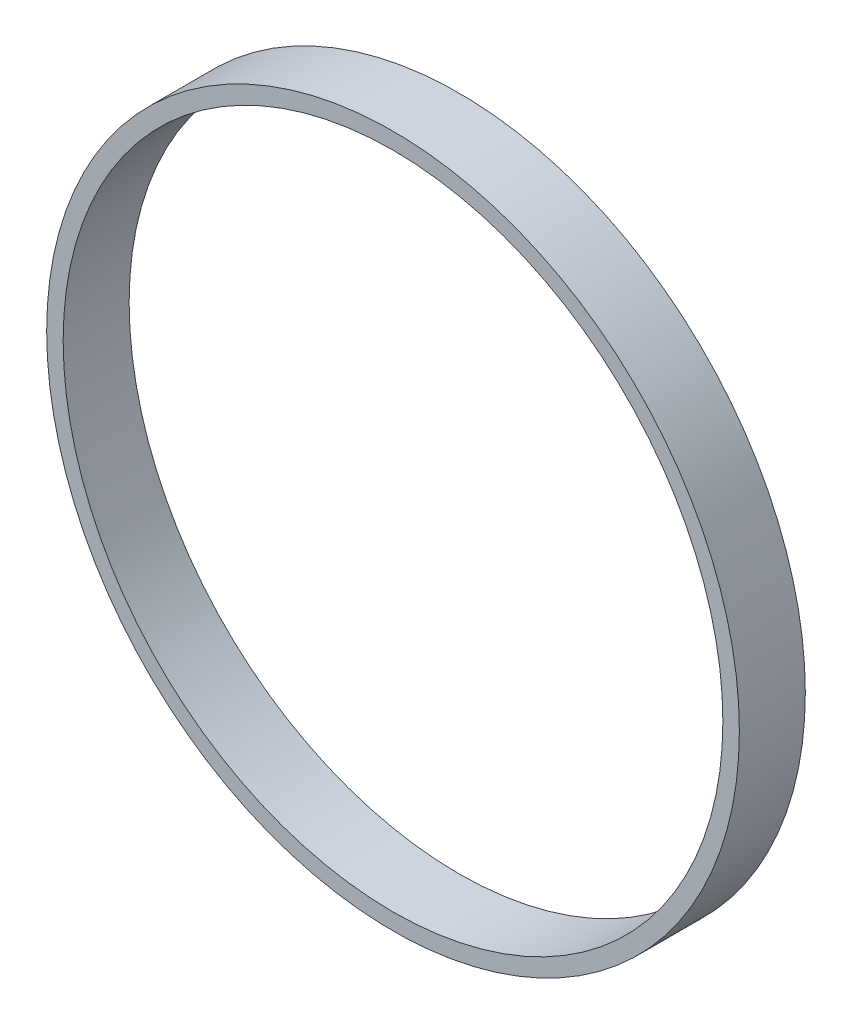
ISO-10303-21;
HEADER;
FILE_DESCRIPTION(('STEP AP214'),'2;1');
FILE_NAME('part.step','',(''),(''),'','','');
FILE_SCHEMA(('AUTOMOTIVE_DESIGN { 1 0 10303 214 1 1 1 1 }'));
ENDSEC;
DATA;
#1=APPLICATION_CONTEXT('core data for automotive mechanical design processes');
#2=APPLICATION_PROTOCOL_DEFINITION('international standard','automotive_design',2000,#1);
#3=PRODUCT_CONTEXT('',#1,'mechanical');
#4=PRODUCT('Part','Part','',(#3));
#5=PRODUCT_RELATED_PRODUCT_CATEGORY('part','',(#4));
#6=PRODUCT_DEFINITION_FORMATION('','',#4);
#7=PRODUCT_DEFINITION_CONTEXT('part definition',#1,'design');
#8=PRODUCT_DEFINITION('design','',#6,#7);
#9=PRODUCT_DEFINITION_SHAPE('','',#8);
#10=(LENGTH_UNIT() NAMED_UNIT(*) SI_UNIT(.MILLI.,.METRE.));
#11=(NAMED_UNIT(*) PLANE_ANGLE_UNIT() SI_UNIT($,.RADIAN.));
#12=(NAMED_UNIT(*) SI_UNIT($,.STERADIAN.) SOLID_ANGLE_UNIT());
#13=UNCERTAINTY_MEASURE_WITH_UNIT(LENGTH_MEASURE(1.E-05),#10,'distance_accuracy_value','');
#14=(GEOMETRIC_REPRESENTATION_CONTEXT(3) GLOBAL_UNCERTAINTY_ASSIGNED_CONTEXT((#13)) GLOBAL_UNIT_ASSIGNED_CONTEXT((#10,
#11,#12)) REPRESENTATION_CONTEXT('',''));
#15=CARTESIAN_POINT('',(0.,0.,0.));
#16=DIRECTION('',(0.,0.,1.));
#17=DIRECTION('',(1.,0.,0.));
#18=AXIS2_PLACEMENT_3D('',#15,#16,#17);
#19=CARTESIAN_POINT('',(0.,0.,20.));
#20=DIRECTION('',(0.,0.,1.));
#21=DIRECTION('',(1.,0.,0.));
#22=AXIS2_PLACEMENT_3D('',#19,#20,#21);
#23=PLANE('',#22);
#24=CARTESIAN_POINT('',(0.,0.,20.));
#25=DIRECTION('',(0.,0.,1.));
#26=DIRECTION('',(1.,0.,0.));
#27=AXIS2_PLACEMENT_3D('',#24,#25,#26);
#28=CIRCLE('',#27,105.);
#29=CARTESIAN_POINT('',(105.,0.,20.));
#30=VERTEX_POINT('',#29);
#31=EDGE_CURVE('E10',#30,#30,#28,.T.);
#32=ORIENTED_EDGE('',*,*,#31,.T.);
#33=EDGE_LOOP('',(#32));
#34=FACE_BOUND('',#33,.T.);
#35=CARTESIAN_POINT('',(0.,0.,20.));
#36=DIRECTION('',(0.,0.,1.));
#37=DIRECTION('',(1.,0.,0.));
#38=AXIS2_PLACEMENT_3D('',#35,#36,#37);
#39=CIRCLE('',#38,100.);
#40=CARTESIAN_POINT('',(100.,0.,20.));
#41=VERTEX_POINT('',#40);
#42=EDGE_CURVE('E48',#41,#41,#39,.T.);
#43=ORIENTED_EDGE('',*,*,#42,.F.);
#44=EDGE_LOOP('',(#43));
#45=FACE_BOUND('',#44,.T.);
#46=ADVANCED_FACE('F37',(#34,#45),#23,.T.);
#47=CARTESIAN_POINT('',(0.,0.,0.));
#48=DIRECTION('',(0.,0.,1.));
#49=DIRECTION('',(1.,0.,0.));
#50=AXIS2_PLACEMENT_3D('',#47,#48,#49);
#51=PLANE('',#50);
#52=CARTESIAN_POINT('',(0.,0.,0.));
#53=DIRECTION('',(0.,0.,1.));
#54=DIRECTION('',(1.,0.,0.));
#55=AXIS2_PLACEMENT_3D('',#52,#53,#54);
#56=CIRCLE('',#55,105.);
#57=CARTESIAN_POINT('',(105.,0.,0.));
#58=VERTEX_POINT('',#57);
#59=EDGE_CURVE('E41',#58,#58,#56,.T.);
#60=ORIENTED_EDGE('',*,*,#59,.F.);
#61=EDGE_LOOP('',(#60));
#62=FACE_BOUND('',#61,.T.);
#63=CARTESIAN_POINT('',(0.,0.,0.));
#64=DIRECTION('',(0.,0.,1.));
#65=DIRECTION('',(1.,0.,0.));
#66=AXIS2_PLACEMENT_3D('',#63,#64,#65);
#67=CIRCLE('',#66,100.);
#68=CARTESIAN_POINT('',(100.,0.,0.));
#69=VERTEX_POINT('',#68);
#70=EDGE_CURVE('E50',#69,#69,#67,.T.);
#71=ORIENTED_EDGE('',*,*,#70,.T.);
#72=EDGE_LOOP('',(#71));
#73=FACE_BOUND('',#72,.T.);
#74=ADVANCED_FACE('F60',(#62,#73),#51,.F.);
#75=CARTESIAN_POINT('',(0.,0.,20.));
#76=DIRECTION('',(0.,0.,-1.));
#77=DIRECTION('',(-1.,0.,0.));
#78=AXIS2_PLACEMENT_3D('',#75,#76,#77);
#79=CYLINDRICAL_SURFACE('',#78,105.);
#80=ORIENTED_EDGE('',*,*,#31,.F.);
#81=EDGE_LOOP('',(#80));
#82=FACE_BOUND('',#81,.T.);
#83=ORIENTED_EDGE('',*,*,#59,.T.);
#84=EDGE_LOOP('',(#83));
#85=FACE_BOUND('',#84,.T.);
#86=ADVANCED_FACE('F39',(#82,#85),#79,.T.);
#87=CARTESIAN_POINT('',(0.,0.,20.));
#88=DIRECTION('',(0.,0.,-1.));
#89=DIRECTION('',(-1.,0.,0.));
#90=AXIS2_PLACEMENT_3D('',#87,#88,#89);
#91=CYLINDRICAL_SURFACE('',#90,100.);
#92=ORIENTED_EDGE('',*,*,#42,.T.);
#93=EDGE_LOOP('',(#92));
#94=FACE_BOUND('',#93,.T.);
#95=ORIENTED_EDGE('',*,*,#70,.F.);
#96=EDGE_LOOP('',(#95));
#97=FACE_BOUND('',#96,.T.);
#98=ADVANCED_FACE('F56',(#94,#97),#91,.F.);
#99=CLOSED_SHELL('',(#46,#74,#86,#98));
#100=MANIFOLD_SOLID_BREP('B2',#99);
#101=ADVANCED_BREP_SHAPE_REPRESENTATION('',(#18,#100),#14);
#102=SHAPE_DEFINITION_REPRESENTATION(#9,#101);
ENDSEC;
END-ISO-10303-21;
